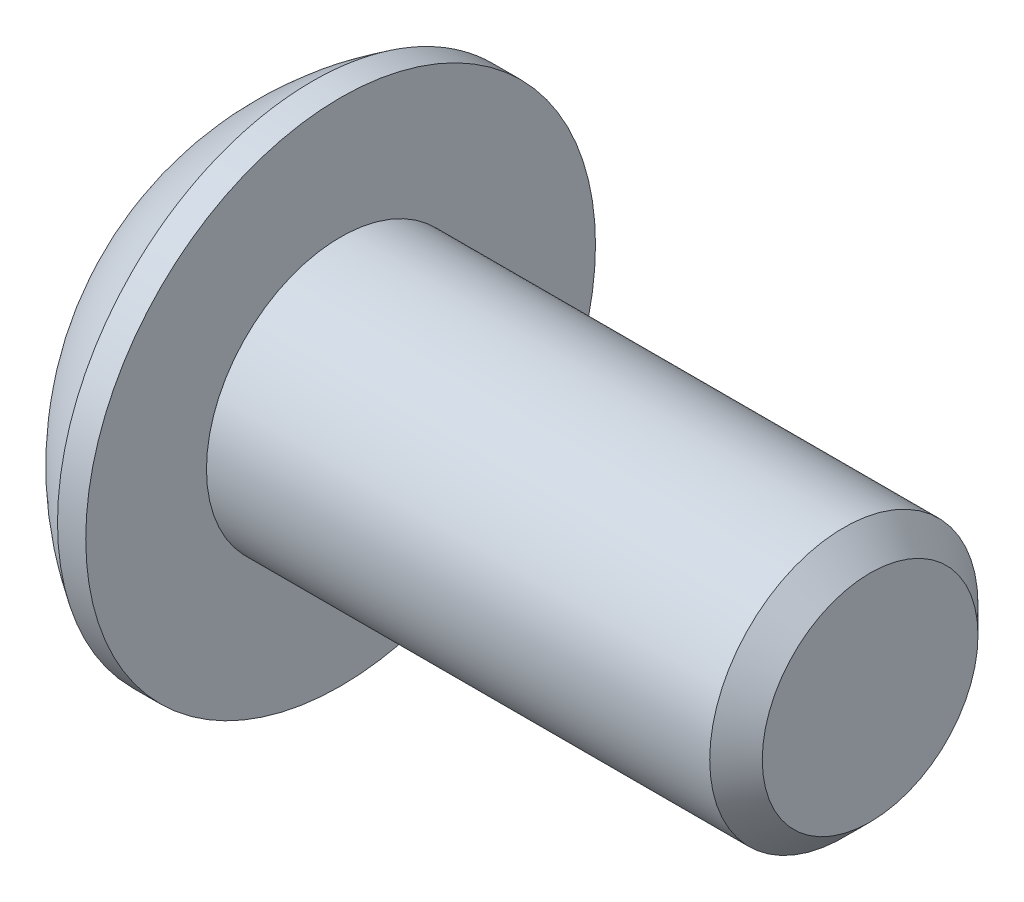
ISO-10303-21;
HEADER;
FILE_DESCRIPTION(('STEP AP214'),'2;1');
FILE_NAME('part.step','',(''),(''),'','','');
FILE_SCHEMA(('AUTOMOTIVE_DESIGN { 1 0 10303 214 1 1 1 1 }'));
ENDSEC;
DATA;
#1=APPLICATION_CONTEXT('core data for automotive mechanical design processes');
#2=APPLICATION_PROTOCOL_DEFINITION('international standard','automotive_design',2000,#1);
#3=PRODUCT_CONTEXT('',#1,'mechanical');
#4=PRODUCT('Part','Part','',(#3));
#5=PRODUCT_RELATED_PRODUCT_CATEGORY('part','',(#4));
#6=PRODUCT_DEFINITION_FORMATION('','',#4);
#7=PRODUCT_DEFINITION_CONTEXT('part definition',#1,'design');
#8=PRODUCT_DEFINITION('design','',#6,#7);
#9=PRODUCT_DEFINITION_SHAPE('','',#8);
#10=(LENGTH_UNIT() NAMED_UNIT(*) SI_UNIT(.MILLI.,.METRE.));
#11=(NAMED_UNIT(*) PLANE_ANGLE_UNIT() SI_UNIT($,.RADIAN.));
#12=(NAMED_UNIT(*) SI_UNIT($,.STERADIAN.) SOLID_ANGLE_UNIT());
#13=UNCERTAINTY_MEASURE_WITH_UNIT(LENGTH_MEASURE(1.E-05),#10,'distance_accuracy_value','');
#14=(GEOMETRIC_REPRESENTATION_CONTEXT(3) GLOBAL_UNCERTAINTY_ASSIGNED_CONTEXT((#13)) GLOBAL_UNIT_ASSIGNED_CONTEXT((#10,
#11,#12)) REPRESENTATION_CONTEXT('',''));
#15=CARTESIAN_POINT('',(0.,0.,0.));
#16=DIRECTION('',(0.,0.,1.));
#17=DIRECTION('',(1.,0.,0.));
#18=AXIS2_PLACEMENT_3D('',#15,#16,#17);
#19=CARTESIAN_POINT('',(1.77800000000006,0.,0.));
#20=DIRECTION('',(-1.,0.,0.));
#21=DIRECTION('',(0.,0.,1.));
#22=AXIS2_PLACEMENT_3D('',#19,#20,#21);
#23=CONICAL_SURFACE('',#22,1.58750000000007,1.04719755119647);
#24=CARTESIAN_POINT('',(2.69454355233878,0.,0.));
#25=VERTEX_POINT('',#24);
#26=VERTEX_LOOP('',#25);
#27=FACE_BOUND('',#26,.T.);
#28=CARTESIAN_POINT('',(1.77800000000006,0.,0.));
#29=DIRECTION('',(-1.,0.,0.));
#30=DIRECTION('',(0.,0.,1.));
#31=AXIS2_PLACEMENT_3D('',#28,#29,#30);
#32=CIRCLE('',#31,1.58750000000007);
#33=CARTESIAN_POINT('',(1.77800000000003,0.,1.58750000000004));
#34=VERTEX_POINT('',#33);
#35=CARTESIAN_POINT('',(1.77800000000003,-1.37481532850783,0.793750000000017));
#36=VERTEX_POINT('',#35);
#37=EDGE_CURVE('E19',#34,#36,#32,.F.);
#38=ORIENTED_EDGE('',*,*,#37,.F.);
#39=CARTESIAN_POINT('',(1.77800000000006,0.,0.));
#40=DIRECTION('',(-1.,0.,0.));
#41=DIRECTION('',(0.,0.,1.));
#42=AXIS2_PLACEMENT_3D('',#39,#40,#41);
#43=CIRCLE('',#42,1.58750000000007);
#44=CARTESIAN_POINT('',(1.77800000000003,1.37481532850783,0.793750000000019));
#45=VERTEX_POINT('',#44);
#46=EDGE_CURVE('E89',#34,#45,#43,.T.);
#47=ORIENTED_EDGE('',*,*,#46,.T.);
#48=CARTESIAN_POINT('',(1.77800000000006,0.,0.));
#49=DIRECTION('',(-1.,0.,0.));
#50=DIRECTION('',(0.,0.,1.));
#51=AXIS2_PLACEMENT_3D('',#48,#49,#50);
#52=CIRCLE('',#51,1.58750000000007);
#53=CARTESIAN_POINT('',(1.77800000000003,1.37481532850783,-0.793750000000019));
#54=VERTEX_POINT('',#53);
#55=EDGE_CURVE('E105',#45,#54,#52,.T.);
#56=ORIENTED_EDGE('',*,*,#55,.T.);
#57=CARTESIAN_POINT('',(1.77800000000006,0.,0.));
#58=DIRECTION('',(-1.,0.,0.));
#59=DIRECTION('',(0.,0.,1.));
#60=AXIS2_PLACEMENT_3D('',#57,#58,#59);
#61=CIRCLE('',#60,1.58750000000007);
#62=CARTESIAN_POINT('',(1.77800000000003,-2.78602967841758E-12,-1.58750000000004));
#63=VERTEX_POINT('',#62);
#64=EDGE_CURVE('E478',#54,#63,#61,.T.);
#65=ORIENTED_EDGE('',*,*,#64,.T.);
#66=CARTESIAN_POINT('',(1.77800000000006,0.,0.));
#67=DIRECTION('',(-1.,0.,0.));
#68=DIRECTION('',(0.,0.,1.));
#69=AXIS2_PLACEMENT_3D('',#66,#67,#68);
#70=CIRCLE('',#69,1.58750000000007);
#71=CARTESIAN_POINT('',(1.77800000000003,-1.37481532850783,-0.793750000000017));
#72=VERTEX_POINT('',#71);
#73=EDGE_CURVE('E480',#72,#63,#70,.F.);
#74=ORIENTED_EDGE('',*,*,#73,.F.);
#75=CARTESIAN_POINT('',(1.77800000000006,0.,0.));
#76=DIRECTION('',(-1.,0.,0.));
#77=DIRECTION('',(0.,0.,1.));
#78=AXIS2_PLACEMENT_3D('',#75,#76,#77);
#79=CIRCLE('',#78,1.58750000000007);
#80=EDGE_CURVE('E92',#36,#72,#79,.F.);
#81=ORIENTED_EDGE('',*,*,#80,.F.);
#82=EDGE_LOOP('',(#38,#47,#56,#65,#74,#81));
#83=FACE_BOUND('',#82,.T.);
#84=ADVANCED_FACE('F16',(#27,#83),#23,.F.);
#85=CARTESIAN_POINT('',(1.778,-2.74963065701559,-1.5875));
#86=DIRECTION('',(1.,0.,0.));
#87=DIRECTION('',(0.,0.,-1.));
#88=AXIS2_PLACEMENT_3D('',#85,#86,#87);
#89=PLANE('',#88);
#90=DIRECTION('',(0.,0.5,0.866025403784439));
#91=VECTOR('',#90,1.);
#92=CARTESIAN_POINT('',(1.778,-1.83308710467706,0.));
#93=LINE('',#92,#91);
#94=CARTESIAN_POINT('',(1.778,-0.91654355233853,1.5875));
#95=VERTEX_POINT('',#94);
#96=EDGE_CURVE('E110',#95,#36,#93,.F.);
#97=ORIENTED_EDGE('',*,*,#96,.F.);
#98=DIRECTION('',(0.,1.,0.));
#99=VECTOR('',#98,1.);
#100=CARTESIAN_POINT('',(1.778,-0.91654355233853,1.5875));
#101=LINE('',#100,#99);
#102=EDGE_CURVE('E108',#34,#95,#101,.F.);
#103=ORIENTED_EDGE('',*,*,#102,.F.);
#104=ORIENTED_EDGE('',*,*,#37,.T.);
#105=EDGE_LOOP('',(#97,#103,#104));
#106=FACE_BOUND('',#105,.T.);
#107=ADVANCED_FACE('F109',(#106),#89,.F.);
#108=CARTESIAN_POINT('',(1.778,-2.74963065701559,-1.5875));
#109=DIRECTION('',(1.,0.,0.));
#110=DIRECTION('',(0.,0.,-1.));
#111=AXIS2_PLACEMENT_3D('',#108,#109,#110);
#112=PLANE('',#111);
#113=DIRECTION('',(0.,-0.5,0.866025403784439));
#114=VECTOR('',#113,1.);
#115=CARTESIAN_POINT('',(1.778,-0.91654355233853,-1.5875));
#116=LINE('',#115,#114);
#117=CARTESIAN_POINT('',(1.778,-1.83308710467706,0.));
#118=VERTEX_POINT('',#117);
#119=EDGE_CURVE('E158',#118,#72,#116,.F.);
#120=ORIENTED_EDGE('',*,*,#119,.F.);
#121=DIRECTION('',(0.,0.5,0.866025403784439));
#122=VECTOR('',#121,1.);
#123=CARTESIAN_POINT('',(1.778,-1.83308710467706,0.));
#124=LINE('',#123,#122);
#125=EDGE_CURVE('E170',#36,#118,#124,.F.);
#126=ORIENTED_EDGE('',*,*,#125,.F.);
#127=ORIENTED_EDGE('',*,*,#80,.T.);
#128=EDGE_LOOP('',(#120,#126,#127));
#129=FACE_BOUND('',#128,.T.);
#130=ADVANCED_FACE('F247',(#129),#112,.F.);
#131=CARTESIAN_POINT('',(1.778,-2.74963065701559,-1.5875));
#132=DIRECTION('',(1.,0.,0.));
#133=DIRECTION('',(0.,0.,-1.));
#134=AXIS2_PLACEMENT_3D('',#131,#132,#133);
#135=PLANE('',#134);
#136=DIRECTION('',(0.,1.,0.));
#137=VECTOR('',#136,1.);
#138=CARTESIAN_POINT('',(1.778,0.916543552338532,-1.5875));
#139=LINE('',#138,#137);
#140=CARTESIAN_POINT('',(1.778,-0.91654355233853,-1.5875));
#141=VERTEX_POINT('',#140);
#142=EDGE_CURVE('E142',#141,#63,#139,.T.);
#143=ORIENTED_EDGE('',*,*,#142,.F.);
#144=DIRECTION('',(0.,-0.5,0.866025403784439));
#145=VECTOR('',#144,1.);
#146=CARTESIAN_POINT('',(1.778,-0.91654355233853,-1.5875));
#147=LINE('',#146,#145);
#148=EDGE_CURVE('E155',#72,#141,#147,.F.);
#149=ORIENTED_EDGE('',*,*,#148,.F.);
#150=ORIENTED_EDGE('',*,*,#73,.T.);
#151=EDGE_LOOP('',(#143,#149,#150));
#152=FACE_BOUND('',#151,.T.);
#153=ADVANCED_FACE('F243',(#152),#135,.F.);
#154=CARTESIAN_POINT('',(1.778,-2.74963065701559,-1.5875));
#155=DIRECTION('',(1.,0.,0.));
#156=DIRECTION('',(0.,0.,-1.));
#157=AXIS2_PLACEMENT_3D('',#154,#155,#156);
#158=PLANE('',#157);
#159=DIRECTION('',(0.,-0.5,-0.866025403784439));
#160=VECTOR('',#159,1.);
#161=CARTESIAN_POINT('',(1.778,1.83308710467706,0.));
#162=LINE('',#161,#160);
#163=CARTESIAN_POINT('',(1.778,0.916543552338532,-1.5875));
#164=VERTEX_POINT('',#163);
#165=EDGE_CURVE('E127',#164,#54,#162,.F.);
#166=ORIENTED_EDGE('',*,*,#165,.F.);
#167=DIRECTION('',(0.,1.,0.));
#168=VECTOR('',#167,1.);
#169=CARTESIAN_POINT('',(1.778,0.916543552338532,-1.5875));
#170=LINE('',#169,#168);
#171=EDGE_CURVE('E139',#63,#164,#170,.T.);
#172=ORIENTED_EDGE('',*,*,#171,.F.);
#173=ORIENTED_EDGE('',*,*,#64,.F.);
#174=EDGE_LOOP('',(#166,#172,#173));
#175=FACE_BOUND('',#174,.T.);
#176=ADVANCED_FACE('F239',(#175),#158,.F.);
#177=CARTESIAN_POINT('',(1.778,-2.74963065701559,-1.5875));
#178=DIRECTION('',(1.,0.,0.));
#179=DIRECTION('',(0.,0.,-1.));
#180=AXIS2_PLACEMENT_3D('',#177,#178,#179);
#181=PLANE('',#180);
#182=DIRECTION('',(0.,0.5,-0.866025403784439));
#183=VECTOR('',#182,1.);
#184=CARTESIAN_POINT('',(1.778,0.916543552338533,1.5875));
#185=LINE('',#184,#183);
#186=CARTESIAN_POINT('',(1.778,1.83308710467706,0.));
#187=VERTEX_POINT('',#186);
#188=EDGE_CURVE('E147',#187,#45,#185,.F.);
#189=ORIENTED_EDGE('',*,*,#188,.F.);
#190=DIRECTION('',(0.,-0.5,-0.866025403784439));
#191=VECTOR('',#190,1.);
#192=CARTESIAN_POINT('',(1.778,1.83308710467706,0.));
#193=LINE('',#192,#191);
#194=EDGE_CURVE('E124',#54,#187,#193,.F.);
#195=ORIENTED_EDGE('',*,*,#194,.F.);
#196=ORIENTED_EDGE('',*,*,#55,.F.);
#197=EDGE_LOOP('',(#189,#195,#196));
#198=FACE_BOUND('',#197,.T.);
#199=ADVANCED_FACE('F236',(#198),#181,.F.);
#200=CARTESIAN_POINT('',(1.778,-2.74963065701559,-1.5875));
#201=DIRECTION('',(1.,0.,0.));
#202=DIRECTION('',(0.,0.,-1.));
#203=AXIS2_PLACEMENT_3D('',#200,#201,#202);
#204=PLANE('',#203);
#205=DIRECTION('',(0.,1.,0.));
#206=VECTOR('',#205,1.);
#207=CARTESIAN_POINT('',(1.778,-0.91654355233853,1.5875));
#208=LINE('',#207,#206);
#209=CARTESIAN_POINT('',(1.778,0.916543552338533,1.5875));
#210=VERTEX_POINT('',#209);
#211=EDGE_CURVE('E100',#210,#34,#208,.F.);
#212=ORIENTED_EDGE('',*,*,#211,.F.);
#213=DIRECTION('',(0.,0.5,-0.866025403784439));
#214=VECTOR('',#213,1.);
#215=CARTESIAN_POINT('',(1.778,0.916543552338533,1.5875));
#216=LINE('',#215,#214);
#217=EDGE_CURVE('E103',#45,#210,#216,.F.);
#218=ORIENTED_EDGE('',*,*,#217,.F.);
#219=ORIENTED_EDGE('',*,*,#46,.F.);
#220=EDGE_LOOP('',(#212,#218,#219));
#221=FACE_BOUND('',#220,.T.);
#222=ADVANCED_FACE('F98',(#221),#204,.F.);
#223=CARTESIAN_POINT('',(1.778,-0.91654355233853,1.5875));
#224=DIRECTION('',(0.,0.,-1.));
#225=DIRECTION('',(0.,1.,0.));
#226=AXIS2_PLACEMENT_3D('',#223,#224,#225);
#227=PLANE('',#226);
#228=DIRECTION('',(0.,1.,0.));
#229=VECTOR('',#228,1.);
#230=CARTESIAN_POINT('',(0.,0.,1.5875));
#231=LINE('',#230,#229);
#232=CARTESIAN_POINT('',(0.,0.916543552338532,1.5875));
#233=VERTEX_POINT('',#232);
#234=CARTESIAN_POINT('',(0.,-0.91654355233853,1.5875));
#235=VERTEX_POINT('',#234);
#236=EDGE_CURVE('E131',#233,#235,#231,.F.);
#237=ORIENTED_EDGE('',*,*,#236,.F.);
#238=DIRECTION('',(1.,0.,0.));
#239=VECTOR('',#238,1.);
#240=CARTESIAN_POINT('',(1.778,0.916543552338533,1.5875));
#241=LINE('',#240,#239);
#242=EDGE_CURVE('E116',#210,#233,#241,.F.);
#243=ORIENTED_EDGE('',*,*,#242,.F.);
#244=ORIENTED_EDGE('',*,*,#211,.T.);
#245=ORIENTED_EDGE('',*,*,#102,.T.);
#246=DIRECTION('',(1.,0.,0.));
#247=VECTOR('',#246,1.);
#248=CARTESIAN_POINT('',(1.778,-0.91654355233853,1.5875));
#249=LINE('',#248,#247);
#250=EDGE_CURVE('E167',#235,#95,#249,.T.);
#251=ORIENTED_EDGE('',*,*,#250,.F.);
#252=EDGE_LOOP('',(#237,#243,#244,#245,#251));
#253=FACE_BOUND('',#252,.T.);
#254=ADVANCED_FACE('F114',(#253),#227,.T.);
#255=CARTESIAN_POINT('',(1.778,-1.83308710467706,0.));
#256=DIRECTION('',(0.,0.866025403784439,-0.5));
#257=DIRECTION('',(0.,0.5,0.866025403784439));
#258=AXIS2_PLACEMENT_3D('',#255,#256,#257);
#259=PLANE('',#258);
#260=DIRECTION('',(0.,-0.5,-0.866025403784439));
#261=VECTOR('',#260,1.);
#262=CARTESIAN_POINT('',(0.,-0.91654355233853,1.5875));
#263=LINE('',#262,#261);
#264=CARTESIAN_POINT('',(0.,-1.83308710467706,0.));
#265=VERTEX_POINT('',#264);
#266=EDGE_CURVE('E464',#235,#265,#263,.T.);
#267=ORIENTED_EDGE('',*,*,#266,.F.);
#268=ORIENTED_EDGE('',*,*,#250,.T.);
#269=ORIENTED_EDGE('',*,*,#96,.T.);
#270=ORIENTED_EDGE('',*,*,#125,.T.);
#271=DIRECTION('',(1.,0.,0.));
#272=VECTOR('',#271,1.);
#273=CARTESIAN_POINT('',(1.778,-1.83308710467706,0.));
#274=LINE('',#273,#272);
#275=EDGE_CURVE('E152',#265,#118,#274,.T.);
#276=ORIENTED_EDGE('',*,*,#275,.F.);
#277=EDGE_LOOP('',(#267,#268,#269,#270,#276));
#278=FACE_BOUND('',#277,.T.);
#279=ADVANCED_FACE('F227',(#278),#259,.T.);
#280=CARTESIAN_POINT('',(1.778,-0.91654355233853,-1.5875));
#281=DIRECTION('',(0.,0.866025403784439,0.5));
#282=DIRECTION('',(0.,-0.5,0.866025403784439));
#283=AXIS2_PLACEMENT_3D('',#280,#281,#282);
#284=PLANE('',#283);
#285=DIRECTION('',(0.,0.5,-0.866025403784439));
#286=VECTOR('',#285,1.);
#287=CARTESIAN_POINT('',(0.,-1.83308710467706,0.));
#288=LINE('',#287,#286);
#289=CARTESIAN_POINT('',(0.,-0.91654355233853,-1.5875));
#290=VERTEX_POINT('',#289);
#291=EDGE_CURVE('E461',#265,#290,#288,.T.);
#292=ORIENTED_EDGE('',*,*,#291,.F.);
#293=ORIENTED_EDGE('',*,*,#275,.T.);
#294=ORIENTED_EDGE('',*,*,#119,.T.);
#295=ORIENTED_EDGE('',*,*,#148,.T.);
#296=DIRECTION('',(1.,0.,0.));
#297=VECTOR('',#296,1.);
#298=CARTESIAN_POINT('',(1.778,-0.91654355233853,-1.5875));
#299=LINE('',#298,#297);
#300=EDGE_CURVE('E136',#290,#141,#299,.T.);
#301=ORIENTED_EDGE('',*,*,#300,.F.);
#302=EDGE_LOOP('',(#292,#293,#294,#295,#301));
#303=FACE_BOUND('',#302,.T.);
#304=ADVANCED_FACE('F223',(#303),#284,.T.);
#305=CARTESIAN_POINT('',(1.778,0.916543552338532,-1.5875));
#306=DIRECTION('',(0.,0.,1.));
#307=DIRECTION('',(1.,0.,0.));
#308=AXIS2_PLACEMENT_3D('',#305,#306,#307);
#309=PLANE('',#308);
#310=DIRECTION('',(0.,1.,0.));
#311=VECTOR('',#310,1.);
#312=CARTESIAN_POINT('',(0.,0.,-1.5875));
#313=LINE('',#312,#311);
#314=CARTESIAN_POINT('',(0.,0.916543552338532,-1.5875));
#315=VERTEX_POINT('',#314);
#316=EDGE_CURVE('E458',#290,#315,#313,.T.);
#317=ORIENTED_EDGE('',*,*,#316,.F.);
#318=ORIENTED_EDGE('',*,*,#300,.T.);
#319=ORIENTED_EDGE('',*,*,#142,.T.);
#320=ORIENTED_EDGE('',*,*,#171,.T.);
#321=DIRECTION('',(1.,0.,0.));
#322=VECTOR('',#321,1.);
#323=CARTESIAN_POINT('',(1.778,0.916543552338532,-1.5875));
#324=LINE('',#323,#322);
#325=EDGE_CURVE('E126',#315,#164,#324,.T.);
#326=ORIENTED_EDGE('',*,*,#325,.F.);
#327=EDGE_LOOP('',(#317,#318,#319,#320,#326));
#328=FACE_BOUND('',#327,.T.);
#329=ADVANCED_FACE('F220',(#328),#309,.T.);
#330=CARTESIAN_POINT('',(1.778,1.83308710467706,0.));
#331=DIRECTION('',(0.,-0.866025403784439,0.5));
#332=DIRECTION('',(0.,-0.5,-0.866025403784439));
#333=AXIS2_PLACEMENT_3D('',#330,#331,#332);
#334=PLANE('',#333);
#335=DIRECTION('',(0.,0.5,0.866025403784438));
#336=VECTOR('',#335,1.);
#337=CARTESIAN_POINT('',(0.,0.916543552338532,-1.5875));
#338=LINE('',#337,#336);
#339=CARTESIAN_POINT('',(0.,1.83308710467706,0.));
#340=VERTEX_POINT('',#339);
#341=EDGE_CURVE('E455',#315,#340,#338,.T.);
#342=ORIENTED_EDGE('',*,*,#341,.F.);
#343=ORIENTED_EDGE('',*,*,#325,.T.);
#344=ORIENTED_EDGE('',*,*,#165,.T.);
#345=ORIENTED_EDGE('',*,*,#194,.T.);
#346=DIRECTION('',(1.,0.,0.));
#347=VECTOR('',#346,1.);
#348=CARTESIAN_POINT('',(1.778,1.83308710467706,0.));
#349=LINE('',#348,#347);
#350=EDGE_CURVE('E34',#340,#187,#349,.T.);
#351=ORIENTED_EDGE('',*,*,#350,.F.);
#352=EDGE_LOOP('',(#342,#343,#344,#345,#351));
#353=FACE_BOUND('',#352,.T.);
#354=ADVANCED_FACE('F216',(#353),#334,.T.);
#355=CARTESIAN_POINT('',(1.778,0.916543552338533,1.5875));
#356=DIRECTION('',(0.,-0.866025403784439,-0.5));
#357=DIRECTION('',(0.,0.5,-0.866025403784439));
#358=AXIS2_PLACEMENT_3D('',#355,#356,#357);
#359=PLANE('',#358);
#360=DIRECTION('',(0.,-0.5,0.866025403784439));
#361=VECTOR('',#360,1.);
#362=CARTESIAN_POINT('',(0.,1.83308710467706,0.));
#363=LINE('',#362,#361);
#364=EDGE_CURVE('E202',#340,#233,#363,.T.);
#365=ORIENTED_EDGE('',*,*,#364,.F.);
#366=ORIENTED_EDGE('',*,*,#350,.T.);
#367=ORIENTED_EDGE('',*,*,#188,.T.);
#368=ORIENTED_EDGE('',*,*,#217,.T.);
#369=ORIENTED_EDGE('',*,*,#242,.T.);
#370=EDGE_LOOP('',(#365,#366,#367,#368,#369));
#371=FACE_BOUND('',#370,.T.);
#372=ADVANCED_FACE('F212',(#371),#359,.T.);
#373=CARTESIAN_POINT('',(0.,0.,0.));
#374=DIRECTION('',(-1.,0.,0.));
#375=DIRECTION('',(0.,0.,1.));
#376=AXIS2_PLACEMENT_3D('',#373,#374,#375);
#377=PLANE('',#376);
#378=ORIENTED_EDGE('',*,*,#341,.T.);
#379=ORIENTED_EDGE('',*,*,#364,.T.);
#380=ORIENTED_EDGE('',*,*,#236,.T.);
#381=ORIENTED_EDGE('',*,*,#266,.T.);
#382=ORIENTED_EDGE('',*,*,#291,.T.);
#383=ORIENTED_EDGE('',*,*,#316,.T.);
#384=EDGE_LOOP('',(#378,#379,#380,#381,#382,#383));
#385=FACE_BOUND('',#384,.T.);
#386=CARTESIAN_POINT('',(0.,2.29235,0.));
#387=CARTESIAN_POINT('',(0.,2.29234961429956,0.0643619991867155));
#388=CARTESIAN_POINT('',(0.,2.28963695190107,0.128735826629365));
#389=CARTESIAN_POINT('',(0.,2.27880393843647,0.257038618985286));
#390=CARTESIAN_POINT('',(0.,2.27068199085126,0.320967446929162));
#391=CARTESIAN_POINT('',(0.,2.24906694794255,0.448021254607717));
#392=CARTESIAN_POINT('',(-2.10840056970795E-13,2.2355653265346,0.51114479338186));
#393=CARTESIAN_POINT('',(2.11879226109671E-13,2.20328400495644,0.636065176149321));
#394=CARTESIAN_POINT('',(7.89917625163527E-13,2.18450002159113,0.697860899533934));
#395=CARTESIAN_POINT('',(1.31285126424162E-12,2.12048422735802,0.880329802927747));
#396=CARTESIAN_POINT('',(0.,2.06753599079459,0.998391795928116));
#397=CARTESIAN_POINT('',(0.,1.94254204858672,1.22393765942147));
#398=CARTESIAN_POINT('',(1.0943500696831E-12,1.87049561696642,1.33142112758208));
#399=CARTESIAN_POINT('',(6.78225420709987E-13,1.7497425419488,1.48237719670935));
#400=CARTESIAN_POINT('',(1.81996039545648E-13,1.707345731323,1.53101280076737));
#401=CARTESIAN_POINT('',(-1.80953624347813E-13,1.61863910291529,1.62450601319185));
#402=CARTESIAN_POINT('',(0.,1.57233309727312,1.66936721890417));
#403=CARTESIAN_POINT('',(0.,1.47608431707233,1.7550488420402));
#404=CARTESIAN_POINT('',(0.,1.42613990458994,1.79586741981512));
#405=CARTESIAN_POINT('',(0.,1.3229945254125,1.87315615311522));
#406=CARTESIAN_POINT('',(0.,1.26979280714187,1.90962529930697));
#407=CARTESIAN_POINT('',(0.,1.10588180153952,2.01207722151089));
#408=CARTESIAN_POINT('',(0.,0.990764947001307,2.07119486286666));
#409=CARTESIAN_POINT('',(0.,0.752302198839713,2.16922858468856));
#410=CARTESIAN_POINT('',(0.,0.628956393121256,2.20814488091449));
#411=CARTESIAN_POINT('',(0.,0.377466101733266,2.2647275576592));
#412=CARTESIAN_POINT('',(0.,0.249321590440377,2.28239382469379));
#413=CARTESIAN_POINT('',(0.,-0.00811435371610997,2.29595665980955));
#414=CARTESIAN_POINT('',(0.,-0.137405786579708,2.29185322789072));
#415=CARTESIAN_POINT('',(0.,-0.393449386933728,2.2620096240906));
#416=CARTESIAN_POINT('',(0.,-0.520201567981086,2.23626956775766));
#417=CARTESIAN_POINT('',(0.,-0.767645294384453,2.16383549332687));
#418=CARTESIAN_POINT('',(0.,-0.888336774993558,2.11714125142685));
#419=CARTESIAN_POINT('',(0.,-1.06210572146656,2.03247976453654));
#420=CARTESIAN_POINT('',(0.,-1.11884498714067,2.00180278323695));
#421=CARTESIAN_POINT('',(0.,-1.22954062855573,1.93578011658036));
#422=CARTESIAN_POINT('',(0.,-1.28349764565393,1.9004355139425));
#423=CARTESIAN_POINT('',(0.,-1.38821676641538,1.82534174602347));
#424=CARTESIAN_POINT('',(0.,-1.43898030563029,1.78559458231503));
#425=CARTESIAN_POINT('',(0.,-1.53701984534432,1.70193996292361));
#426=CARTESIAN_POINT('',(0.,-1.58429243280551,1.65802852924127));
#427=CARTESIAN_POINT('',(0.,-1.72023903553759,1.52059650554139));
#428=CARTESIAN_POINT('',(0.,-1.80318066138239,1.42127847626519));
#429=CARTESIAN_POINT('',(0.,-1.95118232345099,1.21011519784664));
#430=CARTESIAN_POINT('',(0.,-2.01624303935585,1.09827042509272));
#431=CARTESIAN_POINT('',(0.,-2.09907772661315,0.923538238005837));
#432=CARTESIAN_POINT('',(0.,-2.12425103063559,0.864058373981965));
#433=CARTESIAN_POINT('',(0.,-2.16947990046566,0.7432215621756));
#434=CARTESIAN_POINT('',(0.,-2.18953960800685,0.681866178863365));
#435=CARTESIAN_POINT('',(0.,-2.22438542051157,0.557786972400357));
#436=CARTESIAN_POINT('',(0.,-2.23917985294819,0.495065478128173));
#437=CARTESIAN_POINT('',(0.,-2.26343456384454,0.368611258323516));
#438=CARTESIAN_POINT('',(0.,-2.27289641559286,0.30487883675957));
#439=CARTESIAN_POINT('',(0.,-2.28388649696737,0.200873029360625));
#440=CARTESIAN_POINT('',(0.,-2.28705930623294,0.160766164180098));
#441=CARTESIAN_POINT('',(0.,-2.29129117827045,0.0804410725432715));
#442=CARTESIAN_POINT('',(0.,-2.29235024104239,0.0402228460869717));
#443=CARTESIAN_POINT('',(0.,-2.29234961429957,-0.0643619991867168));
#444=CARTESIAN_POINT('',(0.,-2.28963695190109,-0.128735826629366));
#445=CARTESIAN_POINT('',(0.,-2.27880393843648,-0.257038618985287));
#446=CARTESIAN_POINT('',(0.,-2.27068199085127,-0.320967446929163));
#447=CARTESIAN_POINT('',(0.,-2.24906694794256,-0.448021254607718));
#448=CARTESIAN_POINT('',(-2.11158505516439E-13,-2.23556532653461,-0.511144793381861));
#449=CARTESIAN_POINT('',(2.12197933617066E-13,-2.20328400495644,-0.636065176149321));
#450=CARTESIAN_POINT('',(7.91271169771705E-13,-2.18450002159114,-0.697860899533935));
#451=CARTESIAN_POINT('',(1.31534652841856E-12,-2.12048422735803,-0.880329802927748));
#452=CARTESIAN_POINT('',(0.,-2.06753599079459,-0.998391795928114));
#453=CARTESIAN_POINT('',(0.,-1.94254204858673,-1.22393765942147));
#454=CARTESIAN_POINT('',(1.09423089153949E-12,-1.87049561696643,-1.33142112758208));
#455=CARTESIAN_POINT('',(6.78285087865736E-13,-1.74974254194881,-1.48237719670935));
#456=CARTESIAN_POINT('',(1.82011279261461E-13,-1.70734573132301,-1.53101280076737));
#457=CARTESIAN_POINT('',(-1.80968849370244E-13,-1.61863910291529,-1.62450601319185));
#458=CARTESIAN_POINT('',(0.,-1.57233309727313,-1.66936721890417));
#459=CARTESIAN_POINT('',(0.,-1.47608431707234,-1.7550488420402));
#460=CARTESIAN_POINT('',(0.,-1.42613990458995,-1.79586741981512));
#461=CARTESIAN_POINT('',(0.,-1.32299452541251,-1.87315615311522));
#462=CARTESIAN_POINT('',(0.,-1.26979280714188,-1.90962529930696));
#463=CARTESIAN_POINT('',(0.,-1.10588180153952,-2.01207722151089));
#464=CARTESIAN_POINT('',(0.,-0.990764947001314,-2.07119486286666));
#465=CARTESIAN_POINT('',(0.,-0.752302198839721,-2.16922858468856));
#466=CARTESIAN_POINT('',(0.,-0.628956393121265,-2.2081448809145));
#467=CARTESIAN_POINT('',(0.,-0.377466101733274,-2.2647275576592));
#468=CARTESIAN_POINT('',(0.,-0.249321590440385,-2.28239382469379));
#469=CARTESIAN_POINT('',(0.,0.0081143537161019,-2.29595665980955));
#470=CARTESIAN_POINT('',(0.,0.1374057865797,-2.29185322789072));
#471=CARTESIAN_POINT('',(0.,0.39344938693372,-2.2620096240906));
#472=CARTESIAN_POINT('',(0.,0.520201567981077,-2.23626956775766));
#473=CARTESIAN_POINT('',(0.,0.767645294384445,-2.16383549332687));
#474=CARTESIAN_POINT('',(0.,0.88833677499355,-2.11714125142685));
#475=CARTESIAN_POINT('',(0.,1.06210572146656,-2.03247976453654));
#476=CARTESIAN_POINT('',(0.,1.11884498714066,-2.00180278323695));
#477=CARTESIAN_POINT('',(0.,1.22954062855572,-1.93578011658036));
#478=CARTESIAN_POINT('',(0.,1.28349764565392,-1.9004355139425));
#479=CARTESIAN_POINT('',(0.,1.38821676641537,-1.82534174602348));
#480=CARTESIAN_POINT('',(0.,1.43898030563028,-1.78559458231503));
#481=CARTESIAN_POINT('',(0.,1.53701984534431,-1.70193996292361));
#482=CARTESIAN_POINT('',(0.,1.5842924328055,-1.65802852924127));
#483=CARTESIAN_POINT('',(0.,1.72023903553758,-1.52059650554139));
#484=CARTESIAN_POINT('',(0.,1.80318066138238,-1.42127847626519));
#485=CARTESIAN_POINT('',(0.,1.95118232345098,-1.21011519784664));
#486=CARTESIAN_POINT('',(0.,2.01624303935584,-1.09827042509272));
#487=CARTESIAN_POINT('',(0.,2.09907772661315,-0.923538238005838));
#488=CARTESIAN_POINT('',(0.,2.12425103063558,-0.864058373981966));
#489=CARTESIAN_POINT('',(0.,2.16947990046565,-0.7432215621756));
#490=CARTESIAN_POINT('',(0.,2.18953960800684,-0.681866178863365));
#491=CARTESIAN_POINT('',(0.,2.22438542051156,-0.557786972400357));
#492=CARTESIAN_POINT('',(0.,2.23917985294818,-0.495065478128172));
#493=CARTESIAN_POINT('',(0.,2.26343456384453,-0.368611258323515));
#494=CARTESIAN_POINT('',(0.,2.27289641559286,-0.304878836759569));
#495=CARTESIAN_POINT('',(0.,2.28388649696736,-0.200873029360625));
#496=CARTESIAN_POINT('',(0.,2.28705930623293,-0.160766164180098));
#497=CARTESIAN_POINT('',(0.,2.29129117827044,-0.0804410725432719));
#498=CARTESIAN_POINT('',(0.,2.29235024104238,-0.0402228460869725));
#499=CARTESIAN_POINT('',(0.,2.29235,0.));
#500=B_SPLINE_CURVE_WITH_KNOTS('',3,(#386,#387,#388,#389,#390,#391,#392,#393,#394,#395,#396,
#397,#398,#399,#400,#401,#402,#403,#404,#405,#406,#407,#408,#409,#410,#411,#412,#413,#414,#415,
#416,#417,#418,#419,#420,#421,#422,#423,#424,#425,#426,#427,#428,#429,#430,#431,#432,#433,#434,
#435,#436,#437,#438,#439,#440,#441,#442,#443,#444,#445,#446,#447,#448,#449,#450,#451,#452,#453,
#454,#455,#456,#457,#458,#459,#460,#461,#462,#463,#464,#465,#466,#467,#468,#469,#470,#471,#472,
#473,#474,#475,#476,#477,#478,#479,#480,#481,#482,#483,#484,#485,#486,#487,#488,#489,#490,#491,
#492,#493,#494,#495,#496,#497,#498,#499),.UNSPECIFIED.,.T.,.F.,(4,2,2,2,2,2,2,2,2,2,2,2,2,2,2,2,
2,2,2,2,2,2,2,2,2,2,2,2,2,2,2,2,2,2,2,2,2,2,2,2,2,2,2,2,2,2,2,2,2,2,2,2,2,2,2,2,4),(0.,
0.193048968618033,0.386154939782395,0.579568183995958,0.773138711491038,1.15935703864577,
1.54559004914645,1.73895960916368,1.93214273180063,2.12541336477221,2.31872876140888,
2.70495649282618,3.09118009906583,3.47740576789431,3.86363143672285,4.24985504296253,
4.63608277437979,4.82939817101619,5.02266880398748,5.2158519266242,5.40922148664122,
5.79545449714217,6.18167282429724,6.37524335179261,6.56865659600641,6.76176256717089,
6.95481153578908,7.07545693291922,7.19610233004937,7.3891512986674,7.58225726983176,
7.77567051404533,7.96924104154041,8.35545936869514,8.74169237919581,8.93506193921305,
9.12824506185,9.32151569482158,9.51483109145825,9.90105882287555,10.2872824291152,
10.6735080979437,11.0597337667722,11.4459573730119,11.8321851044292,12.0255005010656,
12.2187711340368,12.4119542566736,12.6053238166906,12.9915568271915,13.3777751543466,
13.571345681842,13.7647589260558,13.9578648972203,14.1509138658384,14.2715592629686,
14.3922046600987),.UNSPECIFIED.);
#501=CARTESIAN_POINT('',(0.,2.29235,0.));
#502=VERTEX_POINT('',#501);
#503=EDGE_CURVE('E196',#502,#502,#500,.T.);
#504=ORIENTED_EDGE('',*,*,#503,.F.);
#505=EDGE_LOOP('',(#504));
#506=FACE_BOUND('',#505,.T.);
#507=ADVANCED_FACE('F208',(#385,#506),#377,.T.);
#508=CARTESIAN_POINT('',(4.85989606481482,0.,0.));
#509=DIRECTION('',(0.,1.,0.));
#510=DIRECTION('',(1.,0.,0.));
#511=AXIS2_PLACEMENT_3D('',#508,#509,#510);
#512=SPHERICAL_SURFACE('',#511,5.37340285883187);
#513=CARTESIAN_POINT('',(2.0574,0.,0.));
#514=DIRECTION('',(-1.,0.,0.));
#515=DIRECTION('',(0.,0.,1.));
#516=AXIS2_PLACEMENT_3D('',#513,#514,#515);
#517=CIRCLE('',#516,4.5847);
#518=CARTESIAN_POINT('',(2.0574,0.,4.5847));
#519=VERTEX_POINT('',#518);
#520=EDGE_CURVE('E193',#519,#519,#517,.F.);
#521=ORIENTED_EDGE('',*,*,#520,.F.);
#522=EDGE_LOOP('',(#521));
#523=FACE_BOUND('',#522,.T.);
#524=ORIENTED_EDGE('',*,*,#503,.T.);
#525=EDGE_LOOP('',(#524));
#526=FACE_BOUND('',#525,.T.);
#527=ADVANCED_FACE('F204',(#523,#526),#512,.T.);
#528=CARTESIAN_POINT('',(12.0904,0.,0.));
#529=DIRECTION('',(-1.,0.,0.));
#530=DIRECTION('',(0.,0.,1.));
#531=AXIS2_PLACEMENT_3D('',#528,#529,#530);
#532=PLANE('',#531);
#533=CARTESIAN_POINT('',(12.09039999992,0.,0.));
#534=DIRECTION('',(-1.,0.,0.));
#535=DIRECTION('',(0.,0.,1.));
#536=AXIS2_PLACEMENT_3D('',#533,#534,#535);
#537=CIRCLE('',#536,1.94055999998);
#538=CARTESIAN_POINT('',(12.09039999992,0.,1.94055999998));
#539=VERTEX_POINT('',#538);
#540=EDGE_CURVE('E190',#539,#539,#537,.T.);
#541=ORIENTED_EDGE('',*,*,#540,.F.);
#542=EDGE_LOOP('',(#541));
#543=FACE_BOUND('',#542,.T.);
#544=ADVANCED_FACE('F276',(#543),#532,.F.);
#545=CARTESIAN_POINT('',(0.,0.,0.));
#546=DIRECTION('',(-1.,0.,0.));
#547=DIRECTION('',(0.,0.,1.));
#548=AXIS2_PLACEMENT_3D('',#545,#546,#547);
#549=CYLINDRICAL_SURFACE('',#548,4.5847);
#550=ORIENTED_EDGE('',*,*,#520,.T.);
#551=EDGE_LOOP('',(#550));
#552=FACE_BOUND('',#551,.T.);
#553=CARTESIAN_POINT('',(2.5654,0.,0.));
#554=DIRECTION('',(-1.,0.,0.));
#555=DIRECTION('',(0.,0.,1.));
#556=AXIS2_PLACEMENT_3D('',#553,#554,#555);
#557=CIRCLE('',#556,4.5847);
#558=CARTESIAN_POINT('',(2.5654,0.,4.5847));
#559=VERTEX_POINT('',#558);
#560=EDGE_CURVE('E187',#559,#559,#557,.T.);
#561=ORIENTED_EDGE('',*,*,#560,.T.);
#562=EDGE_LOOP('',(#561));
#563=FACE_BOUND('',#562,.T.);
#564=ADVANCED_FACE('F273',(#552,#563),#549,.T.);
#565=CARTESIAN_POINT('',(11.6179599999668,0.,0.));
#566=DIRECTION('',(-1.,0.,0.));
#567=DIRECTION('',(0.,0.,1.));
#568=AXIS2_PLACEMENT_3D('',#565,#566,#567);
#569=CONICAL_SURFACE('',#568,2.41299999993316,0.785398163397448);
#570=CARTESIAN_POINT('',(11.61796,0.,0.));
#571=DIRECTION('',(-1.,0.,0.));
#572=DIRECTION('',(0.,0.,1.));
#573=AXIS2_PLACEMENT_3D('',#570,#571,#572);
#574=CIRCLE('',#573,2.413);
#575=CARTESIAN_POINT('',(11.61796,0.,2.413));
#576=VERTEX_POINT('',#575);
#577=EDGE_CURVE('E25',#576,#576,#574,.T.);
#578=ORIENTED_EDGE('',*,*,#577,.F.);
#579=EDGE_LOOP('',(#578));
#580=FACE_BOUND('',#579,.T.);
#581=ORIENTED_EDGE('',*,*,#540,.T.);
#582=EDGE_LOOP('',(#581));
#583=FACE_BOUND('',#582,.T.);
#584=ADVANCED_FACE('F266',(#580,#583),#569,.T.);
#585=CARTESIAN_POINT('',(2.5654,2.41299999999999,0.));
#586=DIRECTION('',(-1.,0.,0.));
#587=DIRECTION('',(0.,0.,1.));
#588=AXIS2_PLACEMENT_3D('',#585,#586,#587);
#589=PLANE('',#588);
#590=CARTESIAN_POINT('',(2.5654,0.,0.));
#591=DIRECTION('',(-1.,0.,0.));
#592=DIRECTION('',(0.,0.,1.));
#593=AXIS2_PLACEMENT_3D('',#590,#591,#592);
#594=CIRCLE('',#593,2.413);
#595=CARTESIAN_POINT('',(2.5654,0.,2.413));
#596=VERTEX_POINT('',#595);
#597=EDGE_CURVE('E11',#596,#596,#594,.F.);
#598=ORIENTED_EDGE('',*,*,#597,.F.);
#599=EDGE_LOOP('',(#598));
#600=FACE_BOUND('',#599,.T.);
#601=ORIENTED_EDGE('',*,*,#560,.F.);
#602=EDGE_LOOP('',(#601));
#603=FACE_BOUND('',#602,.T.);
#604=ADVANCED_FACE('F260',(#600,#603),#589,.F.);
#605=CARTESIAN_POINT('',(0.,0.,0.));
#606=DIRECTION('',(-1.,0.,0.));
#607=DIRECTION('',(0.,0.,1.));
#608=AXIS2_PLACEMENT_3D('',#605,#606,#607);
#609=CYLINDRICAL_SURFACE('',#608,2.413);
#610=ORIENTED_EDGE('',*,*,#597,.T.);
#611=EDGE_LOOP('',(#610));
#612=FACE_BOUND('',#611,.T.);
#613=ORIENTED_EDGE('',*,*,#577,.T.);
#614=EDGE_LOOP('',(#613));
#615=FACE_BOUND('',#614,.T.);
#616=ADVANCED_FACE('F258',(#612,#615),#609,.T.);
#617=CLOSED_SHELL('',(#84,#107,#130,#153,#176,#199,#222,#254,#279,#304,#329,#354,#372,#507,#527,
#544,#564,#584,#604,#616));
#618=MANIFOLD_SOLID_BREP('B1',#617);
#619=ADVANCED_BREP_SHAPE_REPRESENTATION('',(#18,#618),#14);
#620=SHAPE_DEFINITION_REPRESENTATION(#9,#619);
ENDSEC;
END-ISO-10303-21;
